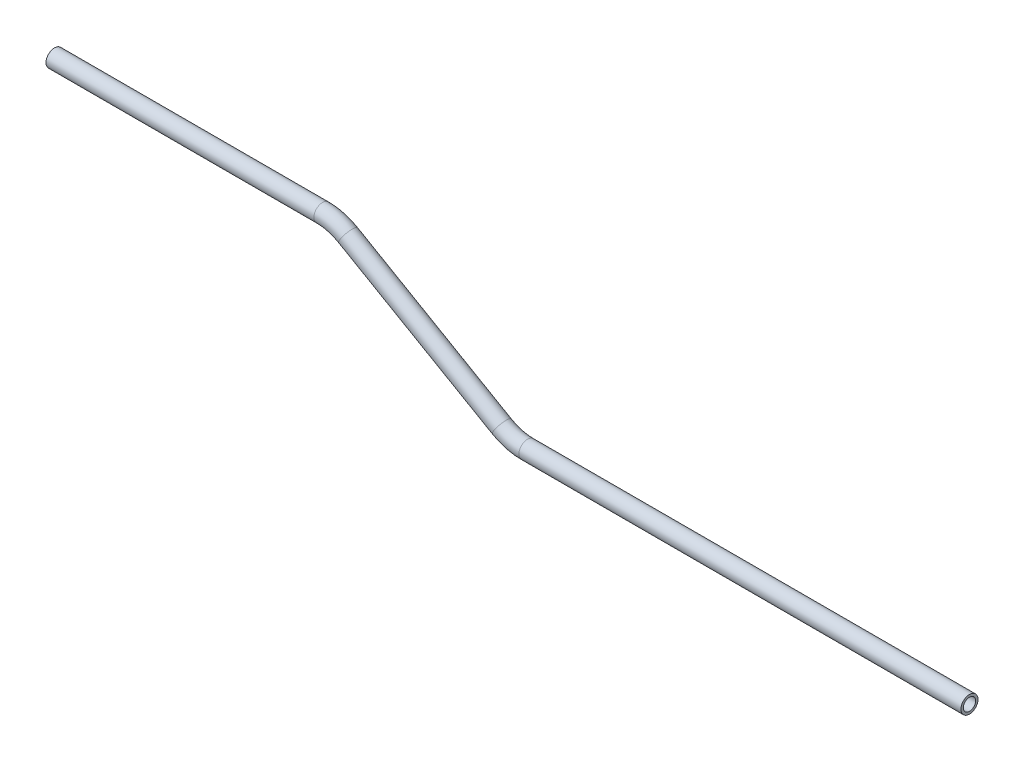
ISO-10303-21;
HEADER;
FILE_DESCRIPTION(('STEP AP214'),'2;1');
FILE_NAME('part.step','',(''),(''),'','','');
FILE_SCHEMA(('AUTOMOTIVE_DESIGN { 1 0 10303 214 1 1 1 1 }'));
ENDSEC;
DATA;
#1=APPLICATION_CONTEXT('core data for automotive mechanical design processes');
#2=APPLICATION_PROTOCOL_DEFINITION('international standard','automotive_design',2000,#1);
#3=PRODUCT_CONTEXT('',#1,'mechanical');
#4=PRODUCT('Part','Part','',(#3));
#5=PRODUCT_RELATED_PRODUCT_CATEGORY('part','',(#4));
#6=PRODUCT_DEFINITION_FORMATION('','',#4);
#7=PRODUCT_DEFINITION_CONTEXT('part definition',#1,'design');
#8=PRODUCT_DEFINITION('design','',#6,#7);
#9=PRODUCT_DEFINITION_SHAPE('','',#8);
#10=(LENGTH_UNIT() NAMED_UNIT(*) SI_UNIT(.MILLI.,.METRE.));
#11=(NAMED_UNIT(*) PLANE_ANGLE_UNIT() SI_UNIT($,.RADIAN.));
#12=(NAMED_UNIT(*) SI_UNIT($,.STERADIAN.) SOLID_ANGLE_UNIT());
#13=UNCERTAINTY_MEASURE_WITH_UNIT(LENGTH_MEASURE(1.E-05),#10,'distance_accuracy_value','');
#14=(GEOMETRIC_REPRESENTATION_CONTEXT(3) GLOBAL_UNCERTAINTY_ASSIGNED_CONTEXT((#13)) GLOBAL_UNIT_ASSIGNED_CONTEXT((#10,
#11,#12)) REPRESENTATION_CONTEXT('',''));
#15=CARTESIAN_POINT('',(0.,0.,0.));
#16=DIRECTION('',(0.,0.,1.));
#17=DIRECTION('',(1.,0.,0.));
#18=AXIS2_PLACEMENT_3D('',#15,#16,#17);
#19=CARTESIAN_POINT('',(-56.1297831876973,3.07427314219325,0.));
#20=DIRECTION('',(1.,0.,0.));
#21=DIRECTION('',(0.,1.,0.));
#22=AXIS2_PLACEMENT_3D('',#19,#20,#21);
#23=CYLINDRICAL_SURFACE('',#22,3.175);
#24=CARTESIAN_POINT('',(43.4658546964898,3.07427314219325,0.));
#25=DIRECTION('',(1.,0.,0.));
#26=DIRECTION('',(0.,1.,0.));
#27=AXIS2_PLACEMENT_3D('',#24,#25,#26);
#28=CIRCLE('',#27,3.175);
#29=CARTESIAN_POINT('',(43.4658546964898,6.24927314219325,0.));
#30=VERTEX_POINT('',#29);
#31=EDGE_CURVE('E56',#30,#30,#28,.T.);
#32=ORIENTED_EDGE('',*,*,#31,.F.);
#33=EDGE_LOOP('',(#32));
#34=FACE_BOUND('',#33,.T.);
#35=CARTESIAN_POINT('',(-56.1297831876973,3.07427314219325,0.));
#36=DIRECTION('',(1.,0.,0.));
#37=DIRECTION('',(0.,1.,0.));
#38=AXIS2_PLACEMENT_3D('',#35,#36,#37);
#39=CIRCLE('',#38,3.175);
#40=CARTESIAN_POINT('',(-56.1297831876973,6.24927314219325,0.));
#41=VERTEX_POINT('',#40);
#42=EDGE_CURVE('E53',#41,#41,#39,.T.);
#43=ORIENTED_EDGE('',*,*,#42,.T.);
#44=EDGE_LOOP('',(#43));
#45=FACE_BOUND('',#44,.T.);
#46=ADVANCED_FACE('F32',(#34,#45),#23,.T.);
#47=CARTESIAN_POINT('',(43.4658546964898,-15.9757268578068,0.));
#48=DIRECTION('',(0.,0.,-1.));
#49=DIRECTION('',(-1.,0.,0.));
#50=AXIS2_PLACEMENT_3D('',#47,#48,#49);
#51=TOROIDAL_SURFACE('',#50,19.05,3.175);
#52=CARTESIAN_POINT('',(52.9908546964898,0.522057084286792,0.));
#53=DIRECTION('',(0.866025403784438,-0.500000000000001,0.));
#54=DIRECTION('',(0.500000000000001,0.866025403784438,0.));
#55=AXIS2_PLACEMENT_3D('',#52,#53,#54);
#56=CIRCLE('',#55,3.175);
#57=CARTESIAN_POINT('',(54.5783546964898,3.27168774130239,0.));
#58=VERTEX_POINT('',#57);
#59=EDGE_CURVE('E59',#58,#58,#56,.T.);
#60=CARTESIAN_POINT('',(43.4658546964898,-15.9757268578068,0.));
#61=DIRECTION('',(0.,0.,-1.));
#62=DIRECTION('',(-1.,0.,0.));
#63=AXIS2_PLACEMENT_3D('',#60,#61,#62);
#64=CIRCLE('',#63,22.225);
#65=EDGE_CURVE('',#30,#58,#64,.T.);
#66=ORIENTED_EDGE('',*,*,#31,.T.);
#67=ORIENTED_EDGE('',*,*,#59,.F.);
#68=ORIENTED_EDGE('',*,*,#65,.T.);
#69=ORIENTED_EDGE('',*,*,#65,.F.);
#70=EDGE_LOOP('',(#66,#68,#67,#69));
#71=FACE_BOUND('',#70,.T.);
#72=ADVANCED_FACE('F78',(#71),#51,.T.);
#73=CARTESIAN_POINT('',(52.9908546964898,0.522057084286799,0.));
#74=DIRECTION('',(0.866025403784438,-0.500000000000001,0.));
#75=DIRECTION('',(0.500000000000001,0.866025403784438,0.));
#76=AXIS2_PLACEMENT_3D('',#73,#74,#75);
#77=CYLINDRICAL_SURFACE('',#76,3.175);
#78=CARTESIAN_POINT('',(110.14085469649,-32.4735107999003,0.));
#79=DIRECTION('',(0.866025403784438,-0.500000000000001,0.));
#80=DIRECTION('',(0.500000000000001,0.866025403784438,0.));
#81=AXIS2_PLACEMENT_3D('',#78,#79,#80);
#82=CIRCLE('',#81,3.175);
#83=CARTESIAN_POINT('',(108.55335469649,-35.2231414569159,0.));
#84=VERTEX_POINT('',#83);
#85=EDGE_CURVE('E61',#84,#84,#82,.T.);
#86=ORIENTED_EDGE('',*,*,#85,.F.);
#87=EDGE_LOOP('',(#86));
#88=FACE_BOUND('',#87,.T.);
#89=ORIENTED_EDGE('',*,*,#59,.T.);
#90=EDGE_LOOP('',(#89));
#91=FACE_BOUND('',#90,.T.);
#92=ADVANCED_FACE('F71',(#88,#91),#77,.T.);
#93=CARTESIAN_POINT('',(119.66585469649,-15.9757268578067,0.));
#94=DIRECTION('',(0.,0.,1.));
#95=DIRECTION('',(1.,0.,0.));
#96=AXIS2_PLACEMENT_3D('',#93,#94,#95);
#97=TOROIDAL_SURFACE('',#96,19.05,3.175);
#98=CARTESIAN_POINT('',(119.66585469649,-35.0257268578067,0.));
#99=DIRECTION('',(1.,0.,0.));
#100=DIRECTION('',(0.,1.,0.));
#101=AXIS2_PLACEMENT_3D('',#98,#99,#100);
#102=CIRCLE('',#101,3.175);
#103=CARTESIAN_POINT('',(119.66585469649,-38.2007268578067,0.));
#104=VERTEX_POINT('',#103);
#105=EDGE_CURVE('E36',#104,#104,#102,.T.);
#106=CARTESIAN_POINT('',(119.66585469649,-15.9757268578067,0.));
#107=DIRECTION('',(0.,0.,1.));
#108=DIRECTION('',(1.,0.,0.));
#109=AXIS2_PLACEMENT_3D('',#106,#107,#108);
#110=CIRCLE('',#109,22.225);
#111=EDGE_CURVE('',#84,#104,#110,.T.);
#112=ORIENTED_EDGE('',*,*,#85,.T.);
#113=ORIENTED_EDGE('',*,*,#105,.F.);
#114=ORIENTED_EDGE('',*,*,#111,.T.);
#115=ORIENTED_EDGE('',*,*,#111,.F.);
#116=EDGE_LOOP('',(#112,#114,#113,#115));
#117=FACE_BOUND('',#116,.T.);
#118=ADVANCED_FACE('F69',(#117),#97,.T.);
#119=CARTESIAN_POINT('',(119.66585469649,-35.0257268578067,0.));
#120=DIRECTION('',(1.,0.,0.));
#121=DIRECTION('',(0.,0.,-1.));
#122=AXIS2_PLACEMENT_3D('',#119,#120,#121);
#123=CYLINDRICAL_SURFACE('',#122,3.175);
#124=CARTESIAN_POINT('',(283.979422580677,-35.0257268578067,0.));
#125=DIRECTION('',(1.,0.,0.));
#126=DIRECTION('',(0.,1.,0.));
#127=AXIS2_PLACEMENT_3D('',#124,#125,#126);
#128=CIRCLE('',#127,3.175);
#129=CARTESIAN_POINT('',(283.979422580677,-31.8507268578067,0.));
#130=VERTEX_POINT('',#129);
#131=EDGE_CURVE('E49',#130,#130,#128,.T.);
#132=ORIENTED_EDGE('',*,*,#131,.F.);
#133=EDGE_LOOP('',(#132));
#134=FACE_BOUND('',#133,.T.);
#135=ORIENTED_EDGE('',*,*,#105,.T.);
#136=EDGE_LOOP('',(#135));
#137=FACE_BOUND('',#136,.T.);
#138=ADVANCED_FACE('F34',(#134,#137),#123,.T.);
#139=CARTESIAN_POINT('',(-56.1297831876973,3.07427314219325,0.));
#140=DIRECTION('',(1.,0.,0.));
#141=DIRECTION('',(0.,1.,0.));
#142=AXIS2_PLACEMENT_3D('',#139,#140,#141);
#143=PLANE('',#142);
#144=CARTESIAN_POINT('',(-56.1297831876973,3.07427314219325,0.));
#145=DIRECTION('',(1.,0.,0.));
#146=DIRECTION('',(0.,1.,0.));
#147=AXIS2_PLACEMENT_3D('',#144,#145,#146);
#148=CIRCLE('',#147,2.286);
#149=CARTESIAN_POINT('',(-56.1297831876973,5.36027314219325,0.));
#150=VERTEX_POINT('',#149);
#151=EDGE_CURVE('E52',#150,#150,#148,.F.);
#152=ORIENTED_EDGE('',*,*,#151,.F.);
#153=EDGE_LOOP('',(#152));
#154=FACE_BOUND('',#153,.T.);
#155=ORIENTED_EDGE('',*,*,#42,.F.);
#156=EDGE_LOOP('',(#155));
#157=FACE_BOUND('',#156,.T.);
#158=ADVANCED_FACE('F76',(#154,#157),#143,.F.);
#159=CARTESIAN_POINT('',(283.979422580677,-35.0257268578067,0.));
#160=DIRECTION('',(1.,0.,0.));
#161=DIRECTION('',(0.,1.,0.));
#162=AXIS2_PLACEMENT_3D('',#159,#160,#161);
#163=PLANE('',#162);
#164=CARTESIAN_POINT('',(283.979422580677,-35.0257268578067,0.));
#165=DIRECTION('',(1.,0.,0.));
#166=DIRECTION('',(0.,1.,0.));
#167=AXIS2_PLACEMENT_3D('',#164,#165,#166);
#168=CIRCLE('',#167,2.286);
#169=CARTESIAN_POINT('',(283.979422580677,-32.7397268578067,0.));
#170=VERTEX_POINT('',#169);
#171=EDGE_CURVE('E10',#170,#170,#168,.F.);
#172=ORIENTED_EDGE('',*,*,#171,.T.);
#173=EDGE_LOOP('',(#172));
#174=FACE_BOUND('',#173,.T.);
#175=ORIENTED_EDGE('',*,*,#131,.T.);
#176=EDGE_LOOP('',(#175));
#177=FACE_BOUND('',#176,.T.);
#178=ADVANCED_FACE('F95',(#174,#177),#163,.T.);
#179=CARTESIAN_POINT('',(-56.1297831876973,3.07427314219325,0.));
#180=DIRECTION('',(1.,0.,0.));
#181=DIRECTION('',(0.,1.,0.));
#182=AXIS2_PLACEMENT_3D('',#179,#180,#181);
#183=CYLINDRICAL_SURFACE('',#182,2.286);
#184=CARTESIAN_POINT('',(43.4658546964898,3.07427314219325,0.));
#185=DIRECTION('',(1.,0.,0.));
#186=DIRECTION('',(0.,1.,0.));
#187=AXIS2_PLACEMENT_3D('',#184,#185,#186);
#188=CIRCLE('',#187,2.286);
#189=CARTESIAN_POINT('',(43.4658546964898,5.36027314219325,0.));
#190=VERTEX_POINT('',#189);
#191=EDGE_CURVE('E191',#190,#190,#188,.F.);
#192=ORIENTED_EDGE('',*,*,#191,.F.);
#193=EDGE_LOOP('',(#192));
#194=FACE_BOUND('',#193,.T.);
#195=ORIENTED_EDGE('',*,*,#151,.T.);
#196=EDGE_LOOP('',(#195));
#197=FACE_BOUND('',#196,.T.);
#198=ADVANCED_FACE('F98',(#194,#197),#183,.F.);
#199=CARTESIAN_POINT('',(43.4658546964898,-15.9757268578068,0.));
#200=DIRECTION('',(0.,0.,-1.));
#201=DIRECTION('',(-1.,0.,0.));
#202=AXIS2_PLACEMENT_3D('',#199,#200,#201);
#203=TOROIDAL_SURFACE('',#202,19.05,2.286);
#204=CARTESIAN_POINT('',(52.9908546964898,0.522057084286792,0.));
#205=DIRECTION('',(0.866025403784438,-0.500000000000001,0.));
#206=DIRECTION('',(0.500000000000001,0.866025403784438,0.));
#207=AXIS2_PLACEMENT_3D('',#204,#205,#206);
#208=CIRCLE('',#207,2.286);
#209=CARTESIAN_POINT('',(54.1338546964898,2.50179115733802,0.));
#210=VERTEX_POINT('',#209);
#211=EDGE_CURVE('E190',#210,#210,#208,.F.);
#212=CARTESIAN_POINT('',(43.4658546964898,-15.9757268578068,0.));
#213=DIRECTION('',(0.,0.,-1.));
#214=DIRECTION('',(-1.,0.,0.));
#215=AXIS2_PLACEMENT_3D('',#212,#213,#214);
#216=CIRCLE('',#215,21.336);
#217=EDGE_CURVE('',#190,#210,#216,.T.);
#218=ORIENTED_EDGE('',*,*,#191,.T.);
#219=ORIENTED_EDGE('',*,*,#211,.F.);
#220=ORIENTED_EDGE('',*,*,#217,.T.);
#221=ORIENTED_EDGE('',*,*,#217,.F.);
#222=EDGE_LOOP('',(#218,#220,#219,#221));
#223=FACE_BOUND('',#222,.T.);
#224=ADVANCED_FACE('F153',(#223),#203,.F.);
#225=CARTESIAN_POINT('',(52.9908546964898,0.522057084286799,0.));
#226=DIRECTION('',(0.866025403784438,-0.500000000000001,0.));
#227=DIRECTION('',(0.500000000000001,0.866025403784438,0.));
#228=AXIS2_PLACEMENT_3D('',#225,#226,#227);
#229=CYLINDRICAL_SURFACE('',#228,2.286);
#230=CARTESIAN_POINT('',(110.14085469649,-32.4735107999003,0.));
#231=DIRECTION('',(0.866025403784438,-0.500000000000001,0.));
#232=DIRECTION('',(0.500000000000001,0.866025403784438,0.));
#233=AXIS2_PLACEMENT_3D('',#230,#231,#232);
#234=CIRCLE('',#233,2.286);
#235=CARTESIAN_POINT('',(108.99785469649,-34.4532448729515,0.));
#236=VERTEX_POINT('',#235);
#237=EDGE_CURVE('E45',#236,#236,#234,.F.);
#238=ORIENTED_EDGE('',*,*,#237,.F.);
#239=EDGE_LOOP('',(#238));
#240=FACE_BOUND('',#239,.T.);
#241=ORIENTED_EDGE('',*,*,#211,.T.);
#242=EDGE_LOOP('',(#241));
#243=FACE_BOUND('',#242,.T.);
#244=ADVANCED_FACE('F89',(#240,#243),#229,.F.);
#245=CARTESIAN_POINT('',(119.66585469649,-15.9757268578067,0.));
#246=DIRECTION('',(0.,0.,1.));
#247=DIRECTION('',(1.,0.,0.));
#248=AXIS2_PLACEMENT_3D('',#245,#246,#247);
#249=TOROIDAL_SURFACE('',#248,19.05,2.286);
#250=CARTESIAN_POINT('',(119.66585469649,-35.0257268578067,0.));
#251=DIRECTION('',(1.,0.,0.));
#252=DIRECTION('',(0.,1.,0.));
#253=AXIS2_PLACEMENT_3D('',#250,#251,#252);
#254=CIRCLE('',#253,2.286);
#255=CARTESIAN_POINT('',(119.66585469649,-37.3117268578067,0.));
#256=VERTEX_POINT('',#255);
#257=EDGE_CURVE('E40',#256,#256,#254,.F.);
#258=CARTESIAN_POINT('',(119.66585469649,-15.9757268578067,0.));
#259=DIRECTION('',(0.,0.,1.));
#260=DIRECTION('',(1.,0.,0.));
#261=AXIS2_PLACEMENT_3D('',#258,#259,#260);
#262=CIRCLE('',#261,21.336);
#263=EDGE_CURVE('',#236,#256,#262,.T.);
#264=ORIENTED_EDGE('',*,*,#237,.T.);
#265=ORIENTED_EDGE('',*,*,#257,.F.);
#266=ORIENTED_EDGE('',*,*,#263,.T.);
#267=ORIENTED_EDGE('',*,*,#263,.F.);
#268=EDGE_LOOP('',(#264,#266,#265,#267));
#269=FACE_BOUND('',#268,.T.);
#270=ADVANCED_FACE('F83',(#269),#249,.F.);
#271=CARTESIAN_POINT('',(119.66585469649,-35.0257268578067,0.));
#272=DIRECTION('',(1.,0.,0.));
#273=DIRECTION('',(0.,0.,-1.));
#274=AXIS2_PLACEMENT_3D('',#271,#272,#273);
#275=CYLINDRICAL_SURFACE('',#274,2.286);
#276=ORIENTED_EDGE('',*,*,#171,.F.);
#277=EDGE_LOOP('',(#276));
#278=FACE_BOUND('',#277,.T.);
#279=ORIENTED_EDGE('',*,*,#257,.T.);
#280=EDGE_LOOP('',(#279));
#281=FACE_BOUND('',#280,.T.);
#282=ADVANCED_FACE('F81',(#278,#281),#275,.F.);
#283=CLOSED_SHELL('',(#46,#72,#92,#118,#138,#158,#178,#198,#224,#244,#270,#282));
#284=MANIFOLD_SOLID_BREP('B2',#283);
#285=ADVANCED_BREP_SHAPE_REPRESENTATION('',(#18,#284),#14);
#286=SHAPE_DEFINITION_REPRESENTATION(#9,#285);
ENDSEC;
END-ISO-10303-21;
